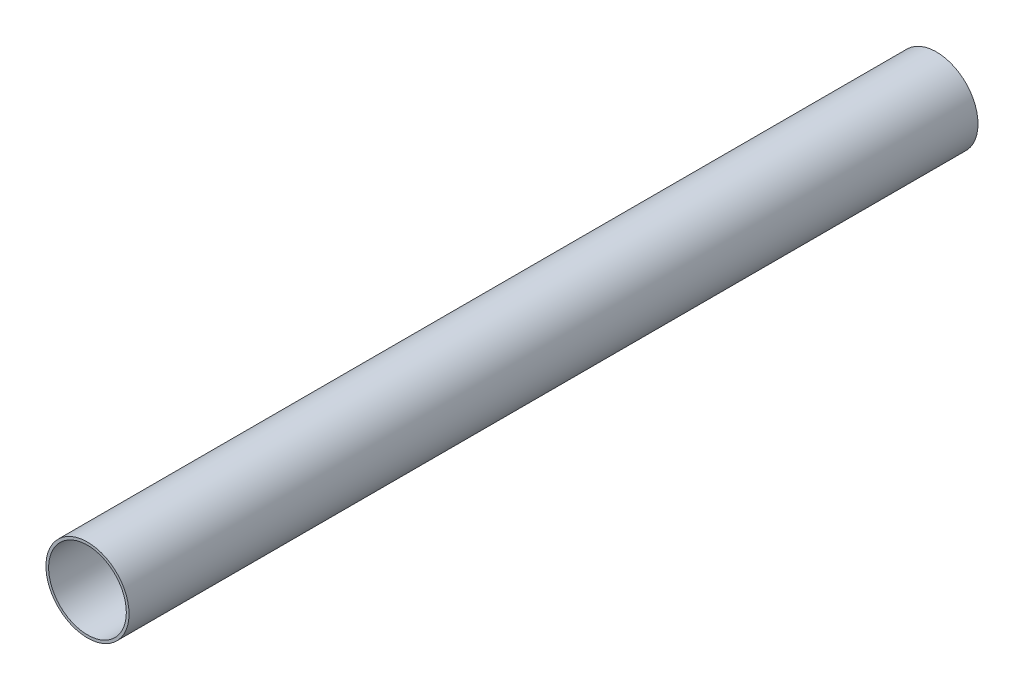
ISO-10303-21;
HEADER;
FILE_DESCRIPTION(('STEP AP214'),'2;1');
FILE_NAME('part.step','',(''),(''),'','','');
FILE_SCHEMA(('AUTOMOTIVE_DESIGN { 1 0 10303 214 1 1 1 1 }'));
ENDSEC;
DATA;
#1=APPLICATION_CONTEXT('core data for automotive mechanical design processes');
#2=APPLICATION_PROTOCOL_DEFINITION('international standard','automotive_design',2000,#1);
#3=PRODUCT_CONTEXT('',#1,'mechanical');
#4=PRODUCT('Part','Part','',(#3));
#5=PRODUCT_RELATED_PRODUCT_CATEGORY('part','',(#4));
#6=PRODUCT_DEFINITION_FORMATION('','',#4);
#7=PRODUCT_DEFINITION_CONTEXT('part definition',#1,'design');
#8=PRODUCT_DEFINITION('design','',#6,#7);
#9=PRODUCT_DEFINITION_SHAPE('','',#8);
#10=(LENGTH_UNIT() NAMED_UNIT(*) SI_UNIT(.MILLI.,.METRE.));
#11=(NAMED_UNIT(*) PLANE_ANGLE_UNIT() SI_UNIT($,.RADIAN.));
#12=(NAMED_UNIT(*) SI_UNIT($,.STERADIAN.) SOLID_ANGLE_UNIT());
#13=UNCERTAINTY_MEASURE_WITH_UNIT(LENGTH_MEASURE(1.E-05),#10,'distance_accuracy_value','');
#14=(GEOMETRIC_REPRESENTATION_CONTEXT(3) GLOBAL_UNCERTAINTY_ASSIGNED_CONTEXT((#13)) GLOBAL_UNIT_ASSIGNED_CONTEXT((#10,
#11,#12)) REPRESENTATION_CONTEXT('',''));
#15=CARTESIAN_POINT('',(0.,0.,0.));
#16=DIRECTION('',(0.,0.,1.));
#17=DIRECTION('',(1.,0.,0.));
#18=AXIS2_PLACEMENT_3D('',#15,#16,#17);
#19=CARTESIAN_POINT('',(0.,0.,1005.332));
#20=DIRECTION('',(0.,0.,1.));
#21=DIRECTION('',(1.,0.,0.));
#22=AXIS2_PLACEMENT_3D('',#19,#20,#21);
#23=PLANE('',#22);
#24=CARTESIAN_POINT('',(0.,0.,1005.332));
#25=DIRECTION('',(0.,0.,1.));
#26=DIRECTION('',(1.,0.,0.));
#27=AXIS2_PLACEMENT_3D('',#24,#25,#26);
#28=CIRCLE('',#27,49.2125);
#29=CARTESIAN_POINT('',(49.2125,0.,1005.332));
#30=VERTEX_POINT('',#29);
#31=EDGE_CURVE('E10',#30,#30,#28,.T.);
#32=ORIENTED_EDGE('',*,*,#31,.T.);
#33=EDGE_LOOP('',(#32));
#34=FACE_BOUND('',#33,.T.);
#35=CARTESIAN_POINT('',(0.,0.,1005.332));
#36=DIRECTION('',(0.,0.,1.));
#37=DIRECTION('',(1.,0.,0.));
#38=AXIS2_PLACEMENT_3D('',#35,#36,#37);
#39=CIRCLE('',#38,46.0121);
#40=CARTESIAN_POINT('',(46.0121,0.,1005.332));
#41=VERTEX_POINT('',#40);
#42=EDGE_CURVE('E43',#41,#41,#39,.T.);
#43=ORIENTED_EDGE('',*,*,#42,.F.);
#44=EDGE_LOOP('',(#43));
#45=FACE_BOUND('',#44,.T.);
#46=ADVANCED_FACE('F32',(#34,#45),#23,.T.);
#47=CARTESIAN_POINT('',(0.,0.,0.));
#48=DIRECTION('',(0.,0.,1.));
#49=DIRECTION('',(1.,0.,0.));
#50=AXIS2_PLACEMENT_3D('',#47,#48,#49);
#51=PLANE('',#50);
#52=CARTESIAN_POINT('',(0.,0.,0.));
#53=DIRECTION('',(0.,0.,1.));
#54=DIRECTION('',(1.,0.,0.));
#55=AXIS2_PLACEMENT_3D('',#52,#53,#54);
#56=CIRCLE('',#55,49.2125);
#57=CARTESIAN_POINT('',(49.2125,0.,0.));
#58=VERTEX_POINT('',#57);
#59=EDGE_CURVE('E36',#58,#58,#56,.T.);
#60=ORIENTED_EDGE('',*,*,#59,.F.);
#61=EDGE_LOOP('',(#60));
#62=FACE_BOUND('',#61,.T.);
#63=CARTESIAN_POINT('',(0.,0.,0.));
#64=DIRECTION('',(0.,0.,1.));
#65=DIRECTION('',(1.,0.,0.));
#66=AXIS2_PLACEMENT_3D('',#63,#64,#65);
#67=CIRCLE('',#66,46.0121);
#68=CARTESIAN_POINT('',(46.0121,0.,0.));
#69=VERTEX_POINT('',#68);
#70=EDGE_CURVE('E45',#69,#69,#67,.T.);
#71=ORIENTED_EDGE('',*,*,#70,.T.);
#72=EDGE_LOOP('',(#71));
#73=FACE_BOUND('',#72,.T.);
#74=ADVANCED_FACE('F55',(#62,#73),#51,.F.);
#75=CARTESIAN_POINT('',(0.,0.,1005.332));
#76=DIRECTION('',(0.,0.,-1.));
#77=DIRECTION('',(-1.,0.,0.));
#78=AXIS2_PLACEMENT_3D('',#75,#76,#77);
#79=CYLINDRICAL_SURFACE('',#78,49.2125);
#80=ORIENTED_EDGE('',*,*,#31,.F.);
#81=EDGE_LOOP('',(#80));
#82=FACE_BOUND('',#81,.T.);
#83=ORIENTED_EDGE('',*,*,#59,.T.);
#84=EDGE_LOOP('',(#83));
#85=FACE_BOUND('',#84,.T.);
#86=ADVANCED_FACE('F34',(#82,#85),#79,.T.);
#87=CARTESIAN_POINT('',(0.,0.,1005.332));
#88=DIRECTION('',(0.,0.,-1.));
#89=DIRECTION('',(-1.,0.,0.));
#90=AXIS2_PLACEMENT_3D('',#87,#88,#89);
#91=CYLINDRICAL_SURFACE('',#90,46.0121);
#92=ORIENTED_EDGE('',*,*,#42,.T.);
#93=EDGE_LOOP('',(#92));
#94=FACE_BOUND('',#93,.T.);
#95=ORIENTED_EDGE('',*,*,#70,.F.);
#96=EDGE_LOOP('',(#95));
#97=FACE_BOUND('',#96,.T.);
#98=ADVANCED_FACE('F51',(#94,#97),#91,.F.);
#99=CLOSED_SHELL('',(#46,#74,#86,#98));
#100=MANIFOLD_SOLID_BREP('B2',#99);
#101=ADVANCED_BREP_SHAPE_REPRESENTATION('',(#18,#100),#14);
#102=SHAPE_DEFINITION_REPRESENTATION(#9,#101);
ENDSEC;
END-ISO-10303-21;
